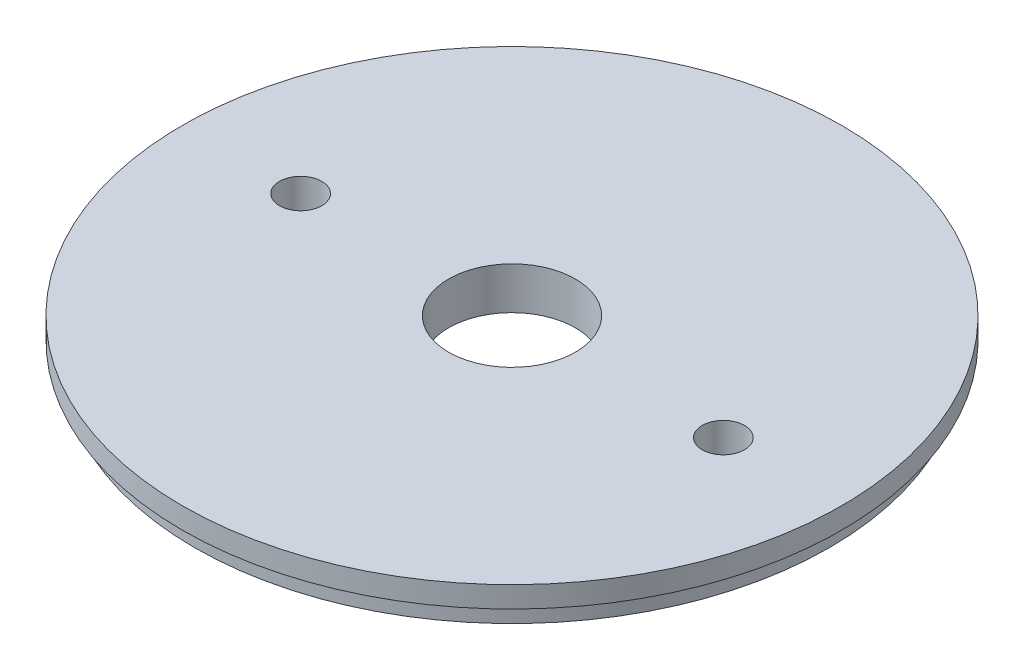
ISO-10303-21;
HEADER;
FILE_DESCRIPTION(('STEP AP214'),'2;1');
FILE_NAME('part.step','',(''),(''),'','','');
FILE_SCHEMA(('AUTOMOTIVE_DESIGN { 1 0 10303 214 1 1 1 1 }'));
ENDSEC;
DATA;
#1=APPLICATION_CONTEXT('core data for automotive mechanical design processes');
#2=APPLICATION_PROTOCOL_DEFINITION('international standard','automotive_design',2000,#1);
#3=PRODUCT_CONTEXT('',#1,'mechanical');
#4=PRODUCT('Part','Part','',(#3));
#5=PRODUCT_RELATED_PRODUCT_CATEGORY('part','',(#4));
#6=PRODUCT_DEFINITION_FORMATION('','',#4);
#7=PRODUCT_DEFINITION_CONTEXT('part definition',#1,'design');
#8=PRODUCT_DEFINITION('design','',#6,#7);
#9=PRODUCT_DEFINITION_SHAPE('','',#8);
#10=(LENGTH_UNIT() NAMED_UNIT(*) SI_UNIT(.MILLI.,.METRE.));
#11=(NAMED_UNIT(*) PLANE_ANGLE_UNIT() SI_UNIT($,.RADIAN.));
#12=(NAMED_UNIT(*) SI_UNIT($,.STERADIAN.) SOLID_ANGLE_UNIT());
#13=UNCERTAINTY_MEASURE_WITH_UNIT(LENGTH_MEASURE(1.E-05),#10,'distance_accuracy_value','');
#14=(GEOMETRIC_REPRESENTATION_CONTEXT(3) GLOBAL_UNCERTAINTY_ASSIGNED_CONTEXT((#13)) GLOBAL_UNIT_ASSIGNED_CONTEXT((#10,
#11,#12)) REPRESENTATION_CONTEXT('',''));
#15=CARTESIAN_POINT('',(0.,0.,0.));
#16=DIRECTION('',(0.,0.,1.));
#17=DIRECTION('',(1.,0.,0.));
#18=AXIS2_PLACEMENT_3D('',#15,#16,#17);
#19=CARTESIAN_POINT('',(0.,3.175,0.));
#20=DIRECTION('',(0.,-1.,0.));
#21=DIRECTION('',(0.,0.,-1.));
#22=AXIS2_PLACEMENT_3D('',#19,#20,#21);
#23=CYLINDRICAL_SURFACE('',#22,47.6885);
#24=CARTESIAN_POINT('',(0.,3.175,0.));
#25=DIRECTION('',(0.,1.,0.));
#26=DIRECTION('',(0.,0.,1.));
#27=AXIS2_PLACEMENT_3D('',#24,#25,#26);
#28=CIRCLE('',#27,47.6885);
#29=CARTESIAN_POINT('',(0.,3.175,47.6885));
#30=VERTEX_POINT('',#29);
#31=EDGE_CURVE('E10',#30,#30,#28,.T.);
#32=ORIENTED_EDGE('',*,*,#31,.F.);
#33=EDGE_LOOP('',(#32));
#34=FACE_BOUND('',#33,.T.);
#35=CARTESIAN_POINT('',(0.,0.,0.));
#36=DIRECTION('',(0.,1.,0.));
#37=DIRECTION('',(0.,0.,1.));
#38=AXIS2_PLACEMENT_3D('',#35,#36,#37);
#39=CIRCLE('',#38,47.6885);
#40=CARTESIAN_POINT('',(0.,0.,47.6885));
#41=VERTEX_POINT('',#40);
#42=EDGE_CURVE('E35',#41,#41,#39,.T.);
#43=ORIENTED_EDGE('',*,*,#42,.T.);
#44=EDGE_LOOP('',(#43));
#45=FACE_BOUND('',#44,.T.);
#46=ADVANCED_FACE('F32',(#34,#45),#23,.T.);
#47=CARTESIAN_POINT('',(0.,0.,0.));
#48=DIRECTION('',(0.,1.,0.));
#49=DIRECTION('',(0.,0.,1.));
#50=AXIS2_PLACEMENT_3D('',#47,#48,#49);
#51=PLANE('',#50);
#52=CARTESIAN_POINT('',(-31.75,0.,0.));
#53=DIRECTION('',(0.,1.,0.));
#54=DIRECTION('',(0.,0.,1.));
#55=AXIS2_PLACEMENT_3D('',#52,#53,#54);
#56=CIRCLE('',#55,3.175);
#57=CARTESIAN_POINT('',(-31.75,0.,3.175));
#58=VERTEX_POINT('',#57);
#59=EDGE_CURVE('E47',#58,#58,#56,.T.);
#60=ORIENTED_EDGE('',*,*,#59,.T.);
#61=EDGE_LOOP('',(#60));
#62=FACE_BOUND('',#61,.T.);
#63=CARTESIAN_POINT('',(31.75,0.,0.));
#64=DIRECTION('',(0.,1.,0.));
#65=DIRECTION('',(0.,0.,1.));
#66=AXIS2_PLACEMENT_3D('',#63,#64,#65);
#67=CIRCLE('',#66,3.17500000000001);
#68=CARTESIAN_POINT('',(31.75,0.,3.17500000000001));
#69=VERTEX_POINT('',#68);
#70=EDGE_CURVE('E59',#69,#69,#67,.T.);
#71=ORIENTED_EDGE('',*,*,#70,.T.);
#72=EDGE_LOOP('',(#71));
#73=FACE_BOUND('',#72,.T.);
#74=CARTESIAN_POINT('',(0.,0.,0.));
#75=DIRECTION('',(0.,1.,0.));
#76=DIRECTION('',(0.,0.,1.));
#77=AXIS2_PLACEMENT_3D('',#74,#75,#76);
#78=CIRCLE('',#77,9.525);
#79=CARTESIAN_POINT('',(0.,0.,9.525));
#80=VERTEX_POINT('',#79);
#81=EDGE_CURVE('E53',#80,#80,#78,.T.);
#82=ORIENTED_EDGE('',*,*,#81,.T.);
#83=EDGE_LOOP('',(#82));
#84=FACE_BOUND('',#83,.T.);
#85=ORIENTED_EDGE('',*,*,#42,.F.);
#86=EDGE_LOOP('',(#85));
#87=FACE_BOUND('',#86,.T.);
#88=ADVANCED_FACE('F68',(#62,#73,#84,#87),#51,.F.);
#89=CARTESIAN_POINT('',(0.,6.35,0.));
#90=DIRECTION('',(0.,-1.,0.));
#91=DIRECTION('',(0.,0.,-1.));
#92=AXIS2_PLACEMENT_3D('',#89,#90,#91);
#93=CYLINDRICAL_SURFACE('',#92,49.5046);
#94=CARTESIAN_POINT('',(0.,6.35,0.));
#95=DIRECTION('',(0.,1.,0.));
#96=DIRECTION('',(0.,0.,1.));
#97=AXIS2_PLACEMENT_3D('',#94,#95,#96);
#98=CIRCLE('',#97,49.5046);
#99=CARTESIAN_POINT('',(0.,6.35,49.5046));
#100=VERTEX_POINT('',#99);
#101=EDGE_CURVE('E42',#100,#100,#98,.T.);
#102=ORIENTED_EDGE('',*,*,#101,.F.);
#103=EDGE_LOOP('',(#102));
#104=FACE_BOUND('',#103,.T.);
#105=CARTESIAN_POINT('',(0.,3.175,0.));
#106=DIRECTION('',(0.,1.,0.));
#107=DIRECTION('',(0.,0.,1.));
#108=AXIS2_PLACEMENT_3D('',#105,#106,#107);
#109=CIRCLE('',#108,49.5046);
#110=CARTESIAN_POINT('',(0.,3.175,49.5046));
#111=VERTEX_POINT('',#110);
#112=EDGE_CURVE('E44',#111,#111,#109,.T.);
#113=ORIENTED_EDGE('',*,*,#112,.T.);
#114=EDGE_LOOP('',(#113));
#115=FACE_BOUND('',#114,.T.);
#116=ADVANCED_FACE('F82',(#104,#115),#93,.T.);
#117=CARTESIAN_POINT('',(0.,6.35,0.));
#118=DIRECTION('',(0.,1.,0.));
#119=DIRECTION('',(0.,0.,1.));
#120=AXIS2_PLACEMENT_3D('',#117,#118,#119);
#121=PLANE('',#120);
#122=CARTESIAN_POINT('',(-31.75,6.35,0.));
#123=DIRECTION('',(0.,1.,0.));
#124=DIRECTION('',(0.,0.,1.));
#125=AXIS2_PLACEMENT_3D('',#122,#123,#124);
#126=CIRCLE('',#125,3.175);
#127=CARTESIAN_POINT('',(-31.75,6.35,3.175));
#128=VERTEX_POINT('',#127);
#129=EDGE_CURVE('E62',#128,#128,#126,.T.);
#130=ORIENTED_EDGE('',*,*,#129,.F.);
#131=EDGE_LOOP('',(#130));
#132=FACE_BOUND('',#131,.T.);
#133=CARTESIAN_POINT('',(31.75,6.35,0.));
#134=DIRECTION('',(0.,1.,0.));
#135=DIRECTION('',(0.,0.,1.));
#136=AXIS2_PLACEMENT_3D('',#133,#134,#135);
#137=CIRCLE('',#136,3.17500000000001);
#138=CARTESIAN_POINT('',(31.75,6.35,3.17500000000001));
#139=VERTEX_POINT('',#138);
#140=EDGE_CURVE('E56',#139,#139,#137,.T.);
#141=ORIENTED_EDGE('',*,*,#140,.F.);
#142=EDGE_LOOP('',(#141));
#143=FACE_BOUND('',#142,.T.);
#144=CARTESIAN_POINT('',(0.,6.35,0.));
#145=DIRECTION('',(0.,1.,0.));
#146=DIRECTION('',(0.,0.,1.));
#147=AXIS2_PLACEMENT_3D('',#144,#145,#146);
#148=CIRCLE('',#147,9.525);
#149=CARTESIAN_POINT('',(0.,6.35,9.525));
#150=VERTEX_POINT('',#149);
#151=EDGE_CURVE('E50',#150,#150,#148,.T.);
#152=ORIENTED_EDGE('',*,*,#151,.F.);
#153=EDGE_LOOP('',(#152));
#154=FACE_BOUND('',#153,.T.);
#155=ORIENTED_EDGE('',*,*,#101,.T.);
#156=EDGE_LOOP('',(#155));
#157=FACE_BOUND('',#156,.T.);
#158=ADVANCED_FACE('F78',(#132,#143,#154,#157),#121,.T.);
#159=CARTESIAN_POINT('',(0.,3.175,0.));
#160=DIRECTION('',(0.,1.,0.));
#161=DIRECTION('',(0.,0.,1.));
#162=AXIS2_PLACEMENT_3D('',#159,#160,#161);
#163=PLANE('',#162);
#164=ORIENTED_EDGE('',*,*,#31,.T.);
#165=EDGE_LOOP('',(#164));
#166=FACE_BOUND('',#165,.T.);
#167=ORIENTED_EDGE('',*,*,#112,.F.);
#168=EDGE_LOOP('',(#167));
#169=FACE_BOUND('',#168,.T.);
#170=ADVANCED_FACE('F81',(#166,#169),#163,.F.);
#171=CARTESIAN_POINT('',(0.,0.,0.));
#172=DIRECTION('',(0.,1.,0.));
#173=DIRECTION('',(0.,0.,1.));
#174=AXIS2_PLACEMENT_3D('',#171,#172,#173);
#175=CYLINDRICAL_SURFACE('',#174,9.525);
#176=ORIENTED_EDGE('',*,*,#81,.F.);
#177=EDGE_LOOP('',(#176));
#178=FACE_BOUND('',#177,.T.);
#179=ORIENTED_EDGE('',*,*,#151,.T.);
#180=EDGE_LOOP('',(#179));
#181=FACE_BOUND('',#180,.T.);
#182=ADVANCED_FACE('F96',(#178,#181),#175,.F.);
#183=CARTESIAN_POINT('',(31.75,0.,0.));
#184=DIRECTION('',(0.,1.,0.));
#185=DIRECTION('',(0.,0.,1.));
#186=AXIS2_PLACEMENT_3D('',#183,#184,#185);
#187=CYLINDRICAL_SURFACE('',#186,3.17500000000001);
#188=ORIENTED_EDGE('',*,*,#70,.F.);
#189=EDGE_LOOP('',(#188));
#190=FACE_BOUND('',#189,.T.);
#191=ORIENTED_EDGE('',*,*,#140,.T.);
#192=EDGE_LOOP('',(#191));
#193=FACE_BOUND('',#192,.T.);
#194=ADVANCED_FACE('F74',(#190,#193),#187,.F.);
#195=CARTESIAN_POINT('',(-31.75,0.,0.));
#196=DIRECTION('',(0.,1.,0.));
#197=DIRECTION('',(0.,0.,1.));
#198=AXIS2_PLACEMENT_3D('',#195,#196,#197);
#199=CYLINDRICAL_SURFACE('',#198,3.175);
#200=ORIENTED_EDGE('',*,*,#59,.F.);
#201=EDGE_LOOP('',(#200));
#202=FACE_BOUND('',#201,.T.);
#203=ORIENTED_EDGE('',*,*,#129,.T.);
#204=EDGE_LOOP('',(#203));
#205=FACE_BOUND('',#204,.T.);
#206=ADVANCED_FACE('F71',(#202,#205),#199,.F.);
#207=CLOSED_SHELL('',(#46,#88,#116,#158,#170,#182,#194,#206));
#208=MANIFOLD_SOLID_BREP('B2',#207);
#209=ADVANCED_BREP_SHAPE_REPRESENTATION('',(#18,#208),#14);
#210=SHAPE_DEFINITION_REPRESENTATION(#9,#209);
ENDSEC;
END-ISO-10303-21;
